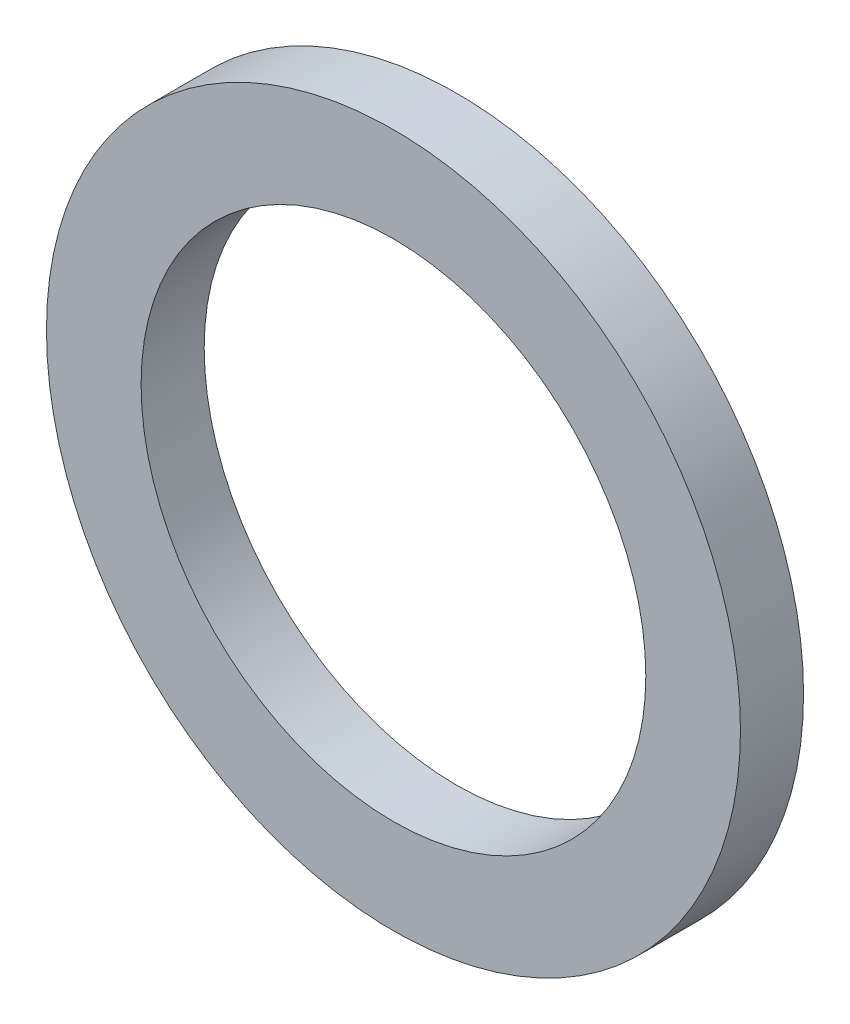
ISO-10303-21;
HEADER;
FILE_DESCRIPTION(('STEP AP214'),'2;1');
FILE_NAME('part.step','',(''),(''),'','','');
FILE_SCHEMA(('AUTOMOTIVE_DESIGN { 1 0 10303 214 1 1 1 1 }'));
ENDSEC;
DATA;
#1=APPLICATION_CONTEXT('core data for automotive mechanical design processes');
#2=APPLICATION_PROTOCOL_DEFINITION('international standard','automotive_design',2000,#1);
#3=PRODUCT_CONTEXT('',#1,'mechanical');
#4=PRODUCT('Part','Part','',(#3));
#5=PRODUCT_RELATED_PRODUCT_CATEGORY('part','',(#4));
#6=PRODUCT_DEFINITION_FORMATION('','',#4);
#7=PRODUCT_DEFINITION_CONTEXT('part definition',#1,'design');
#8=PRODUCT_DEFINITION('design','',#6,#7);
#9=PRODUCT_DEFINITION_SHAPE('','',#8);
#10=(LENGTH_UNIT() NAMED_UNIT(*) SI_UNIT(.MILLI.,.METRE.));
#11=(NAMED_UNIT(*) PLANE_ANGLE_UNIT() SI_UNIT($,.RADIAN.));
#12=(NAMED_UNIT(*) SI_UNIT($,.STERADIAN.) SOLID_ANGLE_UNIT());
#13=UNCERTAINTY_MEASURE_WITH_UNIT(LENGTH_MEASURE(1.E-05),#10,'distance_accuracy_value','');
#14=(GEOMETRIC_REPRESENTATION_CONTEXT(3) GLOBAL_UNCERTAINTY_ASSIGNED_CONTEXT((#13)) GLOBAL_UNIT_ASSIGNED_CONTEXT((#10,
#11,#12)) REPRESENTATION_CONTEXT('',''));
#15=CARTESIAN_POINT('',(0.,0.,0.));
#16=DIRECTION('',(0.,0.,1.));
#17=DIRECTION('',(1.,0.,0.));
#18=AXIS2_PLACEMENT_3D('',#15,#16,#17);
#19=CARTESIAN_POINT('',(0.,0.,1.));
#20=DIRECTION('',(0.,0.,1.));
#21=DIRECTION('',(1.,0.,0.));
#22=AXIS2_PLACEMENT_3D('',#19,#20,#21);
#23=PLANE('',#22);
#24=CARTESIAN_POINT('',(0.,0.,1.));
#25=DIRECTION('',(0.,0.,1.));
#26=DIRECTION('',(1.,0.,0.));
#27=AXIS2_PLACEMENT_3D('',#24,#25,#26);
#28=CIRCLE('',#27,5.5);
#29=CARTESIAN_POINT('',(5.5,0.,1.));
#30=VERTEX_POINT('',#29);
#31=EDGE_CURVE('E11',#30,#30,#28,.T.);
#32=ORIENTED_EDGE('',*,*,#31,.T.);
#33=EDGE_LOOP('',(#32));
#34=FACE_BOUND('',#33,.T.);
#35=CARTESIAN_POINT('',(0.,0.,1.));
#36=DIRECTION('',(0.,0.,1.));
#37=DIRECTION('',(1.,0.,0.));
#38=AXIS2_PLACEMENT_3D('',#35,#36,#37);
#39=CIRCLE('',#38,4.);
#40=CARTESIAN_POINT('',(4.,0.,1.));
#41=VERTEX_POINT('',#40);
#42=EDGE_CURVE('E47',#41,#41,#39,.T.);
#43=ORIENTED_EDGE('',*,*,#42,.F.);
#44=EDGE_LOOP('',(#43));
#45=FACE_BOUND('',#44,.T.);
#46=ADVANCED_FACE('F36',(#34,#45),#23,.T.);
#47=CARTESIAN_POINT('',(0.,0.,0.));
#48=DIRECTION('',(0.,0.,1.));
#49=DIRECTION('',(1.,0.,0.));
#50=AXIS2_PLACEMENT_3D('',#47,#48,#49);
#51=PLANE('',#50);
#52=CARTESIAN_POINT('',(0.,0.,0.));
#53=DIRECTION('',(0.,0.,1.));
#54=DIRECTION('',(1.,0.,0.));
#55=AXIS2_PLACEMENT_3D('',#52,#53,#54);
#56=CIRCLE('',#55,5.5);
#57=CARTESIAN_POINT('',(5.5,0.,0.));
#58=VERTEX_POINT('',#57);
#59=EDGE_CURVE('E40',#58,#58,#56,.T.);
#60=ORIENTED_EDGE('',*,*,#59,.F.);
#61=EDGE_LOOP('',(#60));
#62=FACE_BOUND('',#61,.T.);
#63=CARTESIAN_POINT('',(0.,0.,0.));
#64=DIRECTION('',(0.,0.,1.));
#65=DIRECTION('',(1.,0.,0.));
#66=AXIS2_PLACEMENT_3D('',#63,#64,#65);
#67=CIRCLE('',#66,4.);
#68=CARTESIAN_POINT('',(4.,0.,0.));
#69=VERTEX_POINT('',#68);
#70=EDGE_CURVE('E49',#69,#69,#67,.T.);
#71=ORIENTED_EDGE('',*,*,#70,.T.);
#72=EDGE_LOOP('',(#71));
#73=FACE_BOUND('',#72,.T.);
#74=ADVANCED_FACE('F59',(#62,#73),#51,.F.);
#75=CARTESIAN_POINT('',(0.,0.,1.));
#76=DIRECTION('',(0.,0.,-1.));
#77=DIRECTION('',(-1.,0.,0.));
#78=AXIS2_PLACEMENT_3D('',#75,#76,#77);
#79=CYLINDRICAL_SURFACE('',#78,5.5);
#80=ORIENTED_EDGE('',*,*,#31,.F.);
#81=EDGE_LOOP('',(#80));
#82=FACE_BOUND('',#81,.T.);
#83=ORIENTED_EDGE('',*,*,#59,.T.);
#84=EDGE_LOOP('',(#83));
#85=FACE_BOUND('',#84,.T.);
#86=ADVANCED_FACE('F38',(#82,#85),#79,.T.);
#87=CARTESIAN_POINT('',(0.,0.,1.));
#88=DIRECTION('',(0.,0.,-1.));
#89=DIRECTION('',(-1.,0.,0.));
#90=AXIS2_PLACEMENT_3D('',#87,#88,#89);
#91=CYLINDRICAL_SURFACE('',#90,4.);
#92=ORIENTED_EDGE('',*,*,#42,.T.);
#93=EDGE_LOOP('',(#92));
#94=FACE_BOUND('',#93,.T.);
#95=ORIENTED_EDGE('',*,*,#70,.F.);
#96=EDGE_LOOP('',(#95));
#97=FACE_BOUND('',#96,.T.);
#98=ADVANCED_FACE('F55',(#94,#97),#91,.F.);
#99=CLOSED_SHELL('',(#46,#74,#86,#98));
#100=MANIFOLD_SOLID_BREP('B2',#99);
#101=ADVANCED_BREP_SHAPE_REPRESENTATION('',(#18,#100),#14);
#102=SHAPE_DEFINITION_REPRESENTATION(#9,#101);
ENDSEC;
END-ISO-10303-21;
